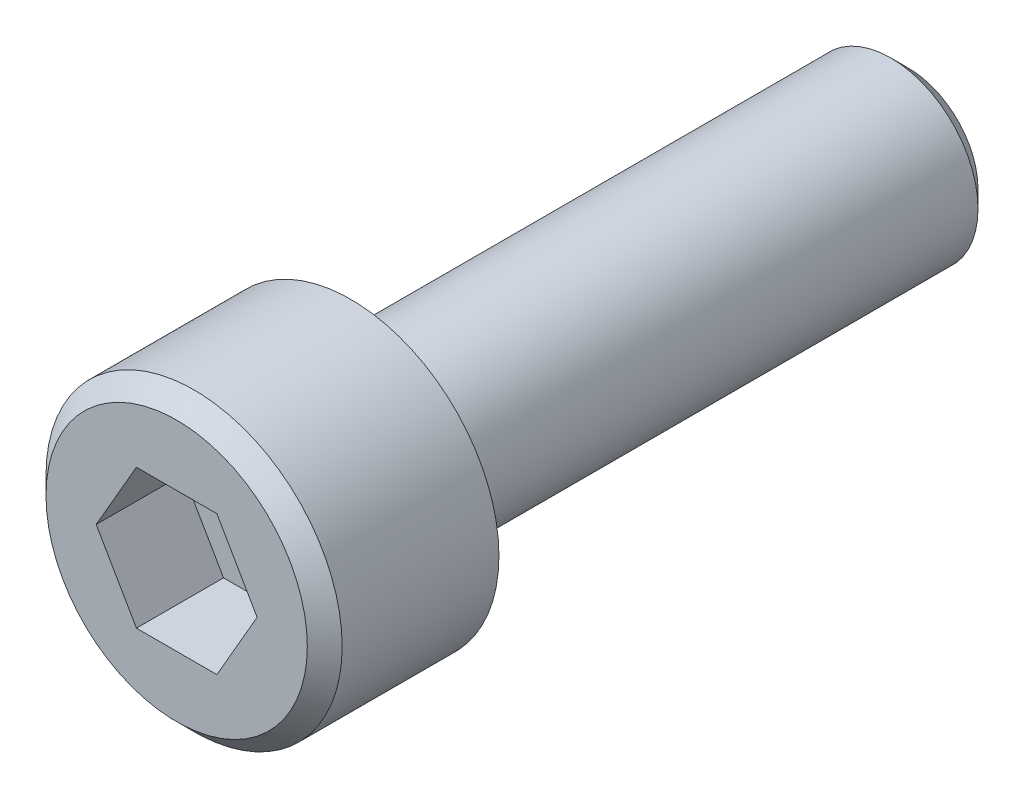
ISO-10303-21;
HEADER;
FILE_DESCRIPTION(('STEP AP214'),'2;1');
FILE_NAME('part.step','',(''),(''),'','','');
FILE_SCHEMA(('AUTOMOTIVE_DESIGN { 1 0 10303 214 1 1 1 1 }'));
ENDSEC;
DATA;
#1=APPLICATION_CONTEXT('core data for automotive mechanical design processes');
#2=APPLICATION_PROTOCOL_DEFINITION('international standard','automotive_design',2000,#1);
#3=PRODUCT_CONTEXT('',#1,'mechanical');
#4=PRODUCT('Part','Part','',(#3));
#5=PRODUCT_RELATED_PRODUCT_CATEGORY('part','',(#4));
#6=PRODUCT_DEFINITION_FORMATION('','',#4);
#7=PRODUCT_DEFINITION_CONTEXT('part definition',#1,'design');
#8=PRODUCT_DEFINITION('design','',#6,#7);
#9=PRODUCT_DEFINITION_SHAPE('','',#8);
#10=(LENGTH_UNIT() NAMED_UNIT(*) SI_UNIT(.MILLI.,.METRE.));
#11=(NAMED_UNIT(*) PLANE_ANGLE_UNIT() SI_UNIT($,.RADIAN.));
#12=(NAMED_UNIT(*) SI_UNIT($,.STERADIAN.) SOLID_ANGLE_UNIT());
#13=UNCERTAINTY_MEASURE_WITH_UNIT(LENGTH_MEASURE(1.E-05),#10,'distance_accuracy_value','');
#14=(GEOMETRIC_REPRESENTATION_CONTEXT(3) GLOBAL_UNCERTAINTY_ASSIGNED_CONTEXT((#13)) GLOBAL_UNIT_ASSIGNED_CONTEXT((#10,
#11,#12)) REPRESENTATION_CONTEXT('',''));
#15=CARTESIAN_POINT('',(0.,0.,0.));
#16=DIRECTION('',(0.,0.,1.));
#17=DIRECTION('',(1.,0.,0.));
#18=AXIS2_PLACEMENT_3D('',#15,#16,#17);
#19=CARTESIAN_POINT('',(-2.4248734116554,2.1000020205975,2.5));
#20=DIRECTION('',(0.,0.,-1.));
#21=DIRECTION('',(1.,0.,0.));
#22=AXIS2_PLACEMENT_3D('',#19,#20,#21);
#23=PLANE('',#22);
#24=DIRECTION('',(-0.499999999999997,-0.86602540378444,0.));
#25=VECTOR('',#24,1.);
#26=CARTESIAN_POINT('',(-1.73204870068105,0.999998509884249,2.5));
#27=LINE('',#26,#25);
#28=CARTESIAN_POINT('',(-1.1546984314914,1.9999985098843,2.5));
#29=VERTEX_POINT('',#28);
#30=CARTESIAN_POINT('',(-2.30939896919293,-1.49128973904548E-06,2.5));
#31=VERTEX_POINT('',#30);
#32=EDGE_CURVE('E79',#29,#31,#27,.T.);
#33=ORIENTED_EDGE('',*,*,#32,.T.);
#34=DIRECTION('',(0.499999999999989,-0.866025403784445,0.));
#35=VECTOR('',#34,1.);
#36=CARTESIAN_POINT('',(-1.73204870068115,-1.0000014901157,2.5));
#37=LINE('',#36,#35);
#38=CARTESIAN_POINT('',(-1.1546984314916,-2.0000014901156,2.5));
#39=VERTEX_POINT('',#38);
#40=EDGE_CURVE('E92',#31,#39,#37,.T.);
#41=ORIENTED_EDGE('',*,*,#40,.T.);
#42=DIRECTION('',(1.,0.,0.));
#43=VECTOR('',#42,1.);
#44=CARTESIAN_POINT('',(2.10688774998462E-06,-2.00000149011565,2.5));
#45=LINE('',#44,#43);
#46=CARTESIAN_POINT('',(1.1547026452671,-2.0000014901157,2.5));
#47=VERTEX_POINT('',#46);
#48=EDGE_CURVE('E99',#39,#47,#45,.T.);
#49=ORIENTED_EDGE('',*,*,#48,.T.);
#50=DIRECTION('',(0.500000000000001,0.866025403784438,0.));
#51=VECTOR('',#50,1.);
#52=CARTESIAN_POINT('',(1.73205291445675,-1.00000149011566,2.5));
#53=LINE('',#52,#51);
#54=CARTESIAN_POINT('',(2.30940318296863,-1.48894168404227E-06,2.5));
#55=VERTEX_POINT('',#54);
#56=EDGE_CURVE('E102',#47,#55,#53,.T.);
#57=ORIENTED_EDGE('',*,*,#56,.T.);
#58=DIRECTION('',(-0.500000000000095,0.866025403784384,0.));
#59=VECTOR('',#58,1.);
#60=CARTESIAN_POINT('',(1.73205291445665,0.999998509884339,2.5));
#61=LINE('',#60,#59);
#62=CARTESIAN_POINT('',(1.1547026452669,1.9999985098843,2.5));
#63=VERTEX_POINT('',#62);
#64=EDGE_CURVE('E81',#55,#63,#61,.T.);
#65=ORIENTED_EDGE('',*,*,#64,.T.);
#66=DIRECTION('',(-1.,0.,0.));
#67=VECTOR('',#66,1.);
#68=CARTESIAN_POINT('',(2.10688775009304E-06,1.9999985098843,2.5));
#69=LINE('',#68,#67);
#70=EDGE_CURVE('E77',#63,#29,#69,.T.);
#71=ORIENTED_EDGE('',*,*,#70,.T.);
#72=EDGE_LOOP('',(#33,#41,#49,#57,#65,#71));
#73=FACE_BOUND('',#72,.T.);
#74=ADVANCED_FACE('F17',(#73),#23,.F.);
#75=CARTESIAN_POINT('',(1.1547026452669,1.9999985098843,2.5));
#76=DIRECTION('',(0.,1.,0.));
#77=DIRECTION('',(-1.,0.,0.));
#78=AXIS2_PLACEMENT_3D('',#75,#76,#77);
#79=PLANE('',#78);
#80=DIRECTION('',(1.,0.,0.));
#81=VECTOR('',#80,1.);
#82=CARTESIAN_POINT('',(0.,1.9999985098843,5.));
#83=LINE('',#82,#81);
#84=CARTESIAN_POINT('',(-1.1546984314914,1.9999985098843,5.));
#85=VERTEX_POINT('',#84);
#86=CARTESIAN_POINT('',(1.1547026452669,1.9999985098843,5.));
#87=VERTEX_POINT('',#86);
#88=EDGE_CURVE('E57',#85,#87,#83,.T.);
#89=ORIENTED_EDGE('',*,*,#88,.F.);
#90=DIRECTION('',(0.,0.,-1.));
#91=VECTOR('',#90,1.);
#92=CARTESIAN_POINT('',(-1.1546984314914,1.9999985098843,3.75));
#93=LINE('',#92,#91);
#94=EDGE_CURVE('E83',#85,#29,#93,.T.);
#95=ORIENTED_EDGE('',*,*,#94,.T.);
#96=ORIENTED_EDGE('',*,*,#70,.F.);
#97=DIRECTION('',(0.,0.,1.));
#98=VECTOR('',#97,1.);
#99=CARTESIAN_POINT('',(1.1547026452669,1.9999985098843,3.75));
#100=LINE('',#99,#98);
#101=EDGE_CURVE('E51',#63,#87,#100,.T.);
#102=ORIENTED_EDGE('',*,*,#101,.T.);
#103=EDGE_LOOP('',(#89,#95,#96,#102));
#104=FACE_BOUND('',#103,.T.);
#105=ADVANCED_FACE('F84',(#104),#79,.F.);
#106=CARTESIAN_POINT('',(2.3094031836464,-1.490115621E-06,2.5));
#107=DIRECTION('',(0.866025403784384,0.500000000000095,0.));
#108=DIRECTION('',(-0.500000000000095,0.866025403784384,0.));
#109=AXIS2_PLACEMENT_3D('',#106,#107,#108);
#110=PLANE('',#109);
#111=DIRECTION('',(0.500000000000096,-0.866025403784383,0.));
#112=VECTOR('',#111,1.);
#113=CARTESIAN_POINT('',(1.1547026452669,1.9999985098843,5.));
#114=LINE('',#113,#112);
#115=CARTESIAN_POINT('',(2.3094031836464,-1.49011562095812E-06,5.));
#116=VERTEX_POINT('',#115);
#117=EDGE_CURVE('E21',#87,#116,#114,.T.);
#118=ORIENTED_EDGE('',*,*,#117,.F.);
#119=ORIENTED_EDGE('',*,*,#101,.F.);
#120=ORIENTED_EDGE('',*,*,#64,.F.);
#121=DIRECTION('',(0.,0.,1.));
#122=VECTOR('',#121,1.);
#123=CARTESIAN_POINT('',(2.3094031836464,-1.490115621E-06,3.75));
#124=LINE('',#123,#122);
#125=EDGE_CURVE('E101',#55,#116,#124,.T.);
#126=ORIENTED_EDGE('',*,*,#125,.T.);
#127=EDGE_LOOP('',(#118,#119,#120,#126));
#128=FACE_BOUND('',#127,.T.);
#129=ADVANCED_FACE('F135',(#128),#110,.F.);
#130=CARTESIAN_POINT('',(1.1547026452671,-2.0000014901157,2.5));
#131=DIRECTION('',(0.866025403784438,-0.500000000000001,0.));
#132=DIRECTION('',(0.500000000000001,0.866025403784438,0.));
#133=AXIS2_PLACEMENT_3D('',#130,#131,#132);
#134=PLANE('',#133);
#135=DIRECTION('',(-0.500000000000001,-0.866025403784438,0.));
#136=VECTOR('',#135,1.);
#137=CARTESIAN_POINT('',(2.3094031836464,-1.49011562117218E-06,5.));
#138=LINE('',#137,#136);
#139=CARTESIAN_POINT('',(1.1547026452671,-2.0000014901157,5.));
#140=VERTEX_POINT('',#139);
#141=EDGE_CURVE('E108',#116,#140,#138,.T.);
#142=ORIENTED_EDGE('',*,*,#141,.F.);
#143=ORIENTED_EDGE('',*,*,#125,.F.);
#144=ORIENTED_EDGE('',*,*,#56,.F.);
#145=DIRECTION('',(0.,0.,1.));
#146=VECTOR('',#145,1.);
#147=CARTESIAN_POINT('',(1.1547026452671,-2.0000014901157,3.75));
#148=LINE('',#147,#146);
#149=EDGE_CURVE('E98',#47,#140,#148,.T.);
#150=ORIENTED_EDGE('',*,*,#149,.T.);
#151=EDGE_LOOP('',(#142,#143,#144,#150));
#152=FACE_BOUND('',#151,.T.);
#153=ADVANCED_FACE('F139',(#152),#134,.F.);
#154=CARTESIAN_POINT('',(-1.1546984314916,-2.0000014901156,2.5));
#155=DIRECTION('',(0.,-1.,0.));
#156=DIRECTION('',(1.,0.,0.));
#157=AXIS2_PLACEMENT_3D('',#154,#155,#156);
#158=PLANE('',#157);
#159=DIRECTION('',(-1.,0.,0.));
#160=VECTOR('',#159,1.);
#161=CARTESIAN_POINT('',(0.,-2.0000014901157,5.));
#162=LINE('',#161,#160);
#163=CARTESIAN_POINT('',(-1.15469843149157,-2.00000149011565,5.));
#164=VERTEX_POINT('',#163);
#165=EDGE_CURVE('E105',#140,#164,#162,.T.);
#166=ORIENTED_EDGE('',*,*,#165,.F.);
#167=ORIENTED_EDGE('',*,*,#149,.F.);
#168=ORIENTED_EDGE('',*,*,#48,.F.);
#169=DIRECTION('',(0.,0.,1.));
#170=VECTOR('',#169,1.);
#171=CARTESIAN_POINT('',(-1.1546984314916,-2.0000014901156,3.75));
#172=LINE('',#171,#170);
#173=EDGE_CURVE('E89',#39,#164,#172,.T.);
#174=ORIENTED_EDGE('',*,*,#173,.T.);
#175=EDGE_LOOP('',(#166,#167,#168,#174));
#176=FACE_BOUND('',#175,.T.);
#177=ADVANCED_FACE('F144',(#176),#158,.F.);
#178=CARTESIAN_POINT('',(-2.3093989698707,-1.490115802E-06,2.5));
#179=DIRECTION('',(-0.866025403784445,-0.499999999999989,0.));
#180=DIRECTION('',(0.499999999999989,-0.866025403784445,0.));
#181=AXIS2_PLACEMENT_3D('',#178,#179,#180);
#182=PLANE('',#181);
#183=DIRECTION('',(-0.499999999999989,0.866025403784445,0.));
#184=VECTOR('',#183,1.);
#185=CARTESIAN_POINT('',(-1.1546984314916,-2.0000014901156,5.));
#186=LINE('',#185,#184);
#187=CARTESIAN_POINT('',(-2.3093989698707,-1.49011580165726E-06,5.));
#188=VERTEX_POINT('',#187);
#189=EDGE_CURVE('E107',#164,#188,#186,.T.);
#190=ORIENTED_EDGE('',*,*,#189,.F.);
#191=ORIENTED_EDGE('',*,*,#173,.F.);
#192=ORIENTED_EDGE('',*,*,#40,.F.);
#193=DIRECTION('',(0.,0.,1.));
#194=VECTOR('',#193,1.);
#195=CARTESIAN_POINT('',(-2.3093989698707,-1.490115802E-06,3.75));
#196=LINE('',#195,#194);
#197=EDGE_CURVE('E36',#31,#188,#196,.T.);
#198=ORIENTED_EDGE('',*,*,#197,.T.);
#199=EDGE_LOOP('',(#190,#191,#192,#198));
#200=FACE_BOUND('',#199,.T.);
#201=ADVANCED_FACE('F146',(#200),#182,.F.);
#202=CARTESIAN_POINT('',(-1.1546984314914,1.9999985098843,2.5));
#203=DIRECTION('',(-0.866025403784441,0.499999999999997,0.));
#204=DIRECTION('',(-0.499999999999997,-0.866025403784441,0.));
#205=AXIS2_PLACEMENT_3D('',#202,#203,#204);
#206=PLANE('',#205);
#207=DIRECTION('',(0.499999999999997,0.86602540378444,0.));
#208=VECTOR('',#207,1.);
#209=CARTESIAN_POINT('',(-2.3093989698707,-1.49011580158342E-06,5.));
#210=LINE('',#209,#208);
#211=EDGE_CURVE('E125',#188,#85,#210,.T.);
#212=ORIENTED_EDGE('',*,*,#211,.F.);
#213=ORIENTED_EDGE('',*,*,#197,.F.);
#214=ORIENTED_EDGE('',*,*,#32,.F.);
#215=ORIENTED_EDGE('',*,*,#94,.F.);
#216=EDGE_LOOP('',(#212,#213,#214,#215));
#217=FACE_BOUND('',#216,.T.);
#218=ADVANCED_FACE('F88',(#217),#206,.F.);
#219=CARTESIAN_POINT('',(-4.125,4.125,5.));
#220=DIRECTION('',(0.,0.,1.));
#221=DIRECTION('',(0.,-1.,0.));
#222=AXIS2_PLACEMENT_3D('',#219,#220,#221);
#223=PLANE('',#222);
#224=ORIENTED_EDGE('',*,*,#189,.T.);
#225=ORIENTED_EDGE('',*,*,#211,.T.);
#226=ORIENTED_EDGE('',*,*,#88,.T.);
#227=ORIENTED_EDGE('',*,*,#117,.T.);
#228=ORIENTED_EDGE('',*,*,#141,.T.);
#229=ORIENTED_EDGE('',*,*,#165,.T.);
#230=EDGE_LOOP('',(#224,#225,#226,#227,#228,#229));
#231=FACE_BOUND('',#230,.T.);
#232=CARTESIAN_POINT('',(0.,0.,5.));
#233=DIRECTION('',(0.,0.,-1.));
#234=DIRECTION('',(-1.,0.,0.));
#235=AXIS2_PLACEMENT_3D('',#232,#233,#234);
#236=CIRCLE('',#235,3.75000000000005);
#237=CARTESIAN_POINT('',(-3.75000000000011,0.,5.));
#238=VERTEX_POINT('',#237);
#239=EDGE_CURVE('E122',#238,#238,#236,.T.);
#240=ORIENTED_EDGE('',*,*,#239,.F.);
#241=EDGE_LOOP('',(#240));
#242=FACE_BOUND('',#241,.T.);
#243=ADVANCED_FACE('F132',(#231,#242),#223,.T.);
#244=CARTESIAN_POINT('',(0.,0.,5.));
#245=DIRECTION('',(0.,0.,-1.));
#246=DIRECTION('',(-1.,0.,0.));
#247=AXIS2_PLACEMENT_3D('',#244,#245,#246);
#248=CONICAL_SURFACE('',#247,3.75000000000005,0.785398163397449);
#249=ORIENTED_EDGE('',*,*,#239,.T.);
#250=EDGE_LOOP('',(#249));
#251=FACE_BOUND('',#250,.T.);
#252=CARTESIAN_POINT('',(0.,0.,4.5));
#253=DIRECTION('',(0.,0.,-1.));
#254=DIRECTION('',(-1.,0.,0.));
#255=AXIS2_PLACEMENT_3D('',#252,#253,#254);
#256=CIRCLE('',#255,4.25000000000001);
#257=CARTESIAN_POINT('',(-4.24999999999997,0.,4.5));
#258=VERTEX_POINT('',#257);
#259=EDGE_CURVE('E96',#258,#258,#256,.T.);
#260=ORIENTED_EDGE('',*,*,#259,.F.);
#261=EDGE_LOOP('',(#260));
#262=FACE_BOUND('',#261,.T.);
#263=ADVANCED_FACE('F180',(#251,#262),#248,.T.);
#264=CARTESIAN_POINT('',(0.,0.,4.5));
#265=DIRECTION('',(0.,0.,-1.));
#266=DIRECTION('',(-1.,0.,0.));
#267=AXIS2_PLACEMENT_3D('',#264,#265,#266);
#268=CYLINDRICAL_SURFACE('',#267,4.25000000000001);
#269=ORIENTED_EDGE('',*,*,#259,.T.);
#270=EDGE_LOOP('',(#269));
#271=FACE_BOUND('',#270,.T.);
#272=CARTESIAN_POINT('',(0.,0.,0.));
#273=DIRECTION('',(0.,0.,-1.));
#274=DIRECTION('',(-1.,0.,0.));
#275=AXIS2_PLACEMENT_3D('',#272,#273,#274);
#276=CIRCLE('',#275,4.25000000000001);
#277=CARTESIAN_POINT('',(-4.24999999999997,0.,0.));
#278=VERTEX_POINT('',#277);
#279=EDGE_CURVE('E119',#278,#278,#276,.T.);
#280=ORIENTED_EDGE('',*,*,#279,.F.);
#281=EDGE_LOOP('',(#280));
#282=FACE_BOUND('',#281,.T.);
#283=ADVANCED_FACE('F172',(#271,#282),#268,.T.);
#284=CARTESIAN_POINT('',(2.2,2.2,-16.));
#285=DIRECTION('',(0.,0.,-1.));
#286=DIRECTION('',(0.,-1.,0.));
#287=AXIS2_PLACEMENT_3D('',#284,#285,#286);
#288=PLANE('',#287);
#289=CARTESIAN_POINT('',(0.,0.,-16.));
#290=DIRECTION('',(0.,0.,1.));
#291=DIRECTION('',(1.,0.,0.));
#292=AXIS2_PLACEMENT_3D('',#289,#290,#291);
#293=CIRCLE('',#292,1.99999999999999);
#294=CARTESIAN_POINT('',(2.,0.,-16.));
#295=VERTEX_POINT('',#294);
#296=EDGE_CURVE('E116',#295,#295,#293,.T.);
#297=ORIENTED_EDGE('',*,*,#296,.F.);
#298=EDGE_LOOP('',(#297));
#299=FACE_BOUND('',#298,.T.);
#300=ADVANCED_FACE('F170',(#299),#288,.T.);
#301=CARTESIAN_POINT('',(4.675,4.675,0.));
#302=DIRECTION('',(0.,0.,-1.));
#303=DIRECTION('',(0.,-1.,0.));
#304=AXIS2_PLACEMENT_3D('',#301,#302,#303);
#305=PLANE('',#304);
#306=CARTESIAN_POINT('',(0.,0.,0.));
#307=DIRECTION('',(0.,0.,-1.));
#308=DIRECTION('',(-1.,0.,0.));
#309=AXIS2_PLACEMENT_3D('',#306,#307,#308);
#310=CIRCLE('',#309,2.5);
#311=CARTESIAN_POINT('',(-2.5,0.,0.));
#312=VERTEX_POINT('',#311);
#313=EDGE_CURVE('E27',#312,#312,#310,.T.);
#314=ORIENTED_EDGE('',*,*,#313,.F.);
#315=EDGE_LOOP('',(#314));
#316=FACE_BOUND('',#315,.T.);
#317=ORIENTED_EDGE('',*,*,#279,.T.);
#318=EDGE_LOOP('',(#317));
#319=FACE_BOUND('',#318,.T.);
#320=ADVANCED_FACE('F162',(#316,#319),#305,.T.);
#321=CARTESIAN_POINT('',(0.,0.,-15.5));
#322=DIRECTION('',(0.,0.,1.));
#323=DIRECTION('',(1.,0.,0.));
#324=AXIS2_PLACEMENT_3D('',#321,#322,#323);
#325=CONICAL_SURFACE('',#324,2.49999999999999,0.785398163397448);
#326=CARTESIAN_POINT('',(0.,0.,-15.5));
#327=DIRECTION('',(0.,0.,1.));
#328=DIRECTION('',(1.,0.,0.));
#329=AXIS2_PLACEMENT_3D('',#326,#327,#328);
#330=CIRCLE('',#329,2.5);
#331=CARTESIAN_POINT('',(2.50000000000001,0.,-15.5));
#332=VERTEX_POINT('',#331);
#333=EDGE_CURVE('E11',#332,#332,#330,.T.);
#334=ORIENTED_EDGE('',*,*,#333,.F.);
#335=EDGE_LOOP('',(#334));
#336=FACE_BOUND('',#335,.T.);
#337=ORIENTED_EDGE('',*,*,#296,.T.);
#338=EDGE_LOOP('',(#337));
#339=FACE_BOUND('',#338,.T.);
#340=ADVANCED_FACE('F157',(#336,#339),#325,.T.);
#341=CARTESIAN_POINT('',(0.,0.,0.));
#342=DIRECTION('',(0.,0.,-1.));
#343=DIRECTION('',(-1.,0.,0.));
#344=AXIS2_PLACEMENT_3D('',#341,#342,#343);
#345=CYLINDRICAL_SURFACE('',#344,2.5);
#346=ORIENTED_EDGE('',*,*,#313,.T.);
#347=EDGE_LOOP('',(#346));
#348=FACE_BOUND('',#347,.T.);
#349=ORIENTED_EDGE('',*,*,#333,.T.);
#350=EDGE_LOOP('',(#349));
#351=FACE_BOUND('',#350,.T.);
#352=ADVANCED_FACE('F19',(#348,#351),#345,.T.);
#353=CLOSED_SHELL('',(#74,#105,#129,#153,#177,#201,#218,#243,#263,#283,#300,#320,#340,#352));
#354=MANIFOLD_SOLID_BREP('B1',#353);
#355=ADVANCED_BREP_SHAPE_REPRESENTATION('',(#18,#354),#14);
#356=SHAPE_DEFINITION_REPRESENTATION(#9,#355);
ENDSEC;
END-ISO-10303-21;
